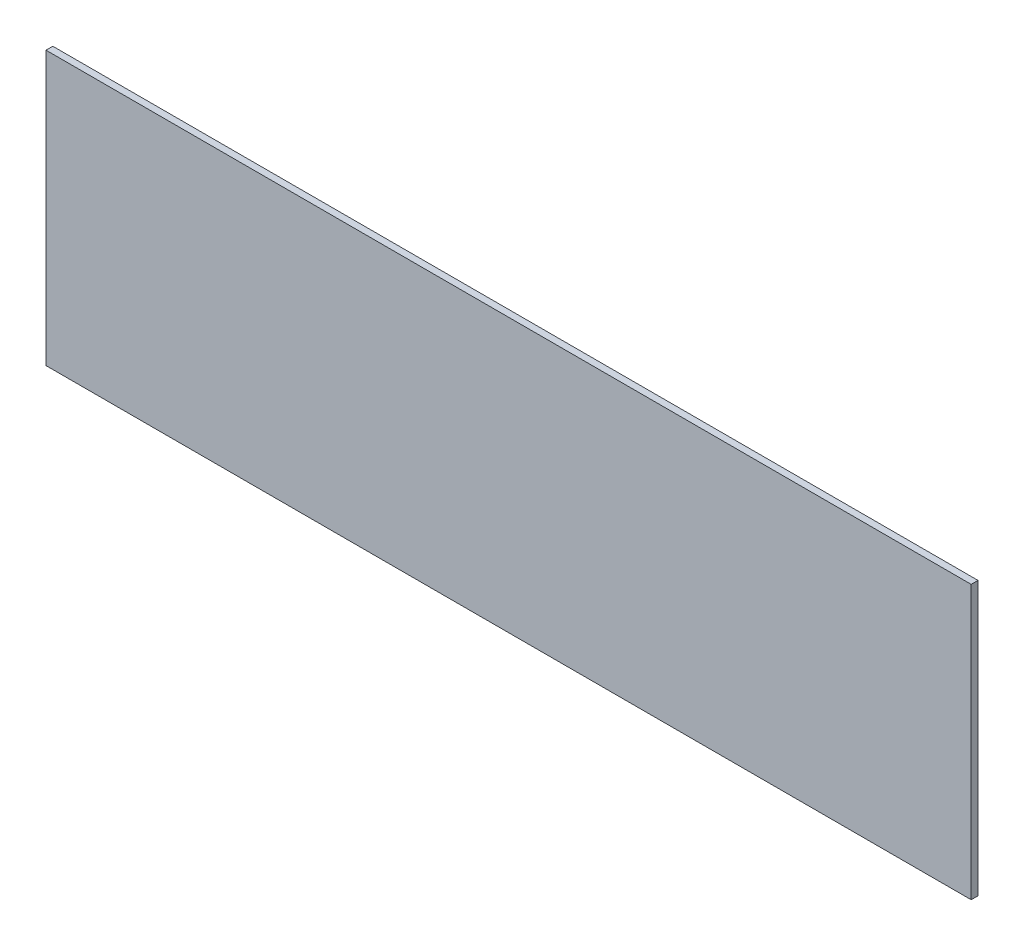
ISO-10303-21;
HEADER;
FILE_DESCRIPTION(('STEP AP214'),'2;1');
FILE_NAME('part.step','',(''),(''),'','','');
FILE_SCHEMA(('AUTOMOTIVE_DESIGN { 1 0 10303 214 1 1 1 1 }'));
ENDSEC;
DATA;
#1=APPLICATION_CONTEXT('core data for automotive mechanical design processes');
#2=APPLICATION_PROTOCOL_DEFINITION('international standard','automotive_design',2000,#1);
#3=PRODUCT_CONTEXT('',#1,'mechanical');
#4=PRODUCT('Part','Part','',(#3));
#5=PRODUCT_RELATED_PRODUCT_CATEGORY('part','',(#4));
#6=PRODUCT_DEFINITION_FORMATION('','',#4);
#7=PRODUCT_DEFINITION_CONTEXT('part definition',#1,'design');
#8=PRODUCT_DEFINITION('design','',#6,#7);
#9=PRODUCT_DEFINITION_SHAPE('','',#8);
#10=(LENGTH_UNIT() NAMED_UNIT(*) SI_UNIT(.MILLI.,.METRE.));
#11=(NAMED_UNIT(*) PLANE_ANGLE_UNIT() SI_UNIT($,.RADIAN.));
#12=(NAMED_UNIT(*) SI_UNIT($,.STERADIAN.) SOLID_ANGLE_UNIT());
#13=UNCERTAINTY_MEASURE_WITH_UNIT(LENGTH_MEASURE(1.E-05),#10,'distance_accuracy_value','');
#14=(GEOMETRIC_REPRESENTATION_CONTEXT(3) GLOBAL_UNCERTAINTY_ASSIGNED_CONTEXT((#13)) GLOBAL_UNIT_ASSIGNED_CONTEXT((#10,
#11,#12)) REPRESENTATION_CONTEXT('',''));
#15=CARTESIAN_POINT('',(0.,0.,0.));
#16=DIRECTION('',(0.,0.,1.));
#17=DIRECTION('',(1.,0.,0.));
#18=AXIS2_PLACEMENT_3D('',#15,#16,#17);
#19=CARTESIAN_POINT('',(101.6,-30.,1.5));
#20=DIRECTION('',(0.,-1.,0.));
#21=DIRECTION('',(1.,0.,0.));
#22=AXIS2_PLACEMENT_3D('',#19,#20,#21);
#23=PLANE('',#22);
#24=DIRECTION('',(-1.,0.,0.));
#25=VECTOR('',#24,1.);
#26=CARTESIAN_POINT('',(101.6,-30.,0.));
#27=LINE('',#26,#25);
#28=CARTESIAN_POINT('',(101.6,-30.,0.));
#29=VERTEX_POINT('',#28);
#30=CARTESIAN_POINT('',(-101.6,-30.,0.));
#31=VERTEX_POINT('',#30);
#32=EDGE_CURVE('E98',#29,#31,#27,.T.);
#33=ORIENTED_EDGE('',*,*,#32,.F.);
#34=DIRECTION('',(0.,0.,-1.));
#35=VECTOR('',#34,1.);
#36=CARTESIAN_POINT('',(101.6,-30.,1.5));
#37=LINE('',#36,#35);
#38=CARTESIAN_POINT('',(101.6,-30.,1.5));
#39=VERTEX_POINT('',#38);
#40=EDGE_CURVE('E11',#39,#29,#37,.T.);
#41=ORIENTED_EDGE('',*,*,#40,.F.);
#42=DIRECTION('',(-1.,0.,0.));
#43=VECTOR('',#42,1.);
#44=CARTESIAN_POINT('',(101.6,-30.,1.5));
#45=LINE('',#44,#43);
#46=CARTESIAN_POINT('',(-101.6,-30.,1.5));
#47=VERTEX_POINT('',#46);
#48=EDGE_CURVE('E93',#39,#47,#45,.T.);
#49=ORIENTED_EDGE('',*,*,#48,.T.);
#50=DIRECTION('',(0.,0.,-1.));
#51=VECTOR('',#50,1.);
#52=CARTESIAN_POINT('',(-101.6,-30.,1.5));
#53=LINE('',#52,#51);
#54=EDGE_CURVE('E36',#47,#31,#53,.T.);
#55=ORIENTED_EDGE('',*,*,#54,.T.);
#56=EDGE_LOOP('',(#33,#41,#49,#55));
#57=FACE_BOUND('',#56,.T.);
#58=ADVANCED_FACE('F33',(#57),#23,.T.);
#59=CARTESIAN_POINT('',(101.6,-30.,1.5));
#60=DIRECTION('',(-1.,0.,0.));
#61=DIRECTION('',(0.,0.,1.));
#62=AXIS2_PLACEMENT_3D('',#59,#60,#61);
#63=PLANE('',#62);
#64=DIRECTION('',(0.,1.,0.));
#65=VECTOR('',#64,1.);
#66=CARTESIAN_POINT('',(101.6,-30.,0.));
#67=LINE('',#66,#65);
#68=CARTESIAN_POINT('',(101.6,30.,0.));
#69=VERTEX_POINT('',#68);
#70=EDGE_CURVE('E66',#29,#69,#67,.T.);
#71=ORIENTED_EDGE('',*,*,#70,.T.);
#72=DIRECTION('',(0.,0.,-1.));
#73=VECTOR('',#72,1.);
#74=CARTESIAN_POINT('',(101.6,30.,1.5));
#75=LINE('',#74,#73);
#76=CARTESIAN_POINT('',(101.6,30.,1.5));
#77=VERTEX_POINT('',#76);
#78=EDGE_CURVE('E42',#77,#69,#75,.T.);
#79=ORIENTED_EDGE('',*,*,#78,.F.);
#80=DIRECTION('',(0.,1.,0.));
#81=VECTOR('',#80,1.);
#82=CARTESIAN_POINT('',(101.6,-30.,1.5));
#83=LINE('',#82,#81);
#84=EDGE_CURVE('E83',#39,#77,#83,.T.);
#85=ORIENTED_EDGE('',*,*,#84,.F.);
#86=ORIENTED_EDGE('',*,*,#40,.T.);
#87=EDGE_LOOP('',(#71,#79,#85,#86));
#88=FACE_BOUND('',#87,.T.);
#89=ADVANCED_FACE('F108',(#88),#63,.F.);
#90=CARTESIAN_POINT('',(101.6,30.,1.5));
#91=DIRECTION('',(0.,-1.,0.));
#92=DIRECTION('',(1.,0.,0.));
#93=AXIS2_PLACEMENT_3D('',#90,#91,#92);
#94=PLANE('',#93);
#95=DIRECTION('',(-1.,0.,0.));
#96=VECTOR('',#95,1.);
#97=CARTESIAN_POINT('',(101.6,30.,0.));
#98=LINE('',#97,#96);
#99=CARTESIAN_POINT('',(-101.6,30.,0.));
#100=VERTEX_POINT('',#99);
#101=EDGE_CURVE('E90',#69,#100,#98,.T.);
#102=ORIENTED_EDGE('',*,*,#101,.T.);
#103=DIRECTION('',(0.,0.,-1.));
#104=VECTOR('',#103,1.);
#105=CARTESIAN_POINT('',(-101.6,30.,1.5));
#106=LINE('',#105,#104);
#107=CARTESIAN_POINT('',(-101.6,30.,1.5));
#108=VERTEX_POINT('',#107);
#109=EDGE_CURVE('E87',#108,#100,#106,.T.);
#110=ORIENTED_EDGE('',*,*,#109,.F.);
#111=DIRECTION('',(-1.,0.,0.));
#112=VECTOR('',#111,1.);
#113=CARTESIAN_POINT('',(101.6,30.,1.5));
#114=LINE('',#113,#112);
#115=EDGE_CURVE('E78',#77,#108,#114,.T.);
#116=ORIENTED_EDGE('',*,*,#115,.F.);
#117=ORIENTED_EDGE('',*,*,#78,.T.);
#118=EDGE_LOOP('',(#102,#110,#116,#117));
#119=FACE_BOUND('',#118,.T.);
#120=ADVANCED_FACE('F88',(#119),#94,.F.);
#121=CARTESIAN_POINT('',(-101.6,-30.,1.5));
#122=DIRECTION('',(-1.,0.,0.));
#123=DIRECTION('',(0.,0.,1.));
#124=AXIS2_PLACEMENT_3D('',#121,#122,#123);
#125=PLANE('',#124);
#126=DIRECTION('',(0.,1.,0.));
#127=VECTOR('',#126,1.);
#128=CARTESIAN_POINT('',(-101.6,-30.,0.));
#129=LINE('',#128,#127);
#130=EDGE_CURVE('E101',#31,#100,#129,.T.);
#131=ORIENTED_EDGE('',*,*,#130,.F.);
#132=ORIENTED_EDGE('',*,*,#54,.F.);
#133=DIRECTION('',(0.,1.,0.));
#134=VECTOR('',#133,1.);
#135=CARTESIAN_POINT('',(-101.6,-30.,1.5));
#136=LINE('',#135,#134);
#137=EDGE_CURVE('E82',#47,#108,#136,.T.);
#138=ORIENTED_EDGE('',*,*,#137,.T.);
#139=ORIENTED_EDGE('',*,*,#109,.T.);
#140=EDGE_LOOP('',(#131,#132,#138,#139));
#141=FACE_BOUND('',#140,.T.);
#142=ADVANCED_FACE('F92',(#141),#125,.T.);
#143=CARTESIAN_POINT('',(0.,0.,1.5));
#144=DIRECTION('',(0.,0.,-1.));
#145=DIRECTION('',(-1.,0.,0.));
#146=AXIS2_PLACEMENT_3D('',#143,#144,#145);
#147=PLANE('',#146);
#148=ORIENTED_EDGE('',*,*,#48,.F.);
#149=ORIENTED_EDGE('',*,*,#84,.T.);
#150=ORIENTED_EDGE('',*,*,#115,.T.);
#151=ORIENTED_EDGE('',*,*,#137,.F.);
#152=EDGE_LOOP('',(#148,#149,#150,#151));
#153=FACE_BOUND('',#152,.T.);
#154=ADVANCED_FACE('F81',(#153),#147,.F.);
#155=CARTESIAN_POINT('',(0.,0.,0.));
#156=DIRECTION('',(0.,0.,-1.));
#157=DIRECTION('',(-1.,0.,0.));
#158=AXIS2_PLACEMENT_3D('',#155,#156,#157);
#159=PLANE('',#158);
#160=ORIENTED_EDGE('',*,*,#32,.T.);
#161=ORIENTED_EDGE('',*,*,#130,.T.);
#162=ORIENTED_EDGE('',*,*,#101,.F.);
#163=ORIENTED_EDGE('',*,*,#70,.F.);
#164=EDGE_LOOP('',(#160,#161,#162,#163));
#165=FACE_BOUND('',#164,.T.);
#166=ADVANCED_FACE('F106',(#165),#159,.T.);
#167=CLOSED_SHELL('',(#58,#89,#120,#142,#154,#166));
#168=MANIFOLD_SOLID_BREP('B2',#167);
#169=ADVANCED_BREP_SHAPE_REPRESENTATION('',(#18,#168),#14);
#170=SHAPE_DEFINITION_REPRESENTATION(#9,#169);
ENDSEC;
END-ISO-10303-21;
